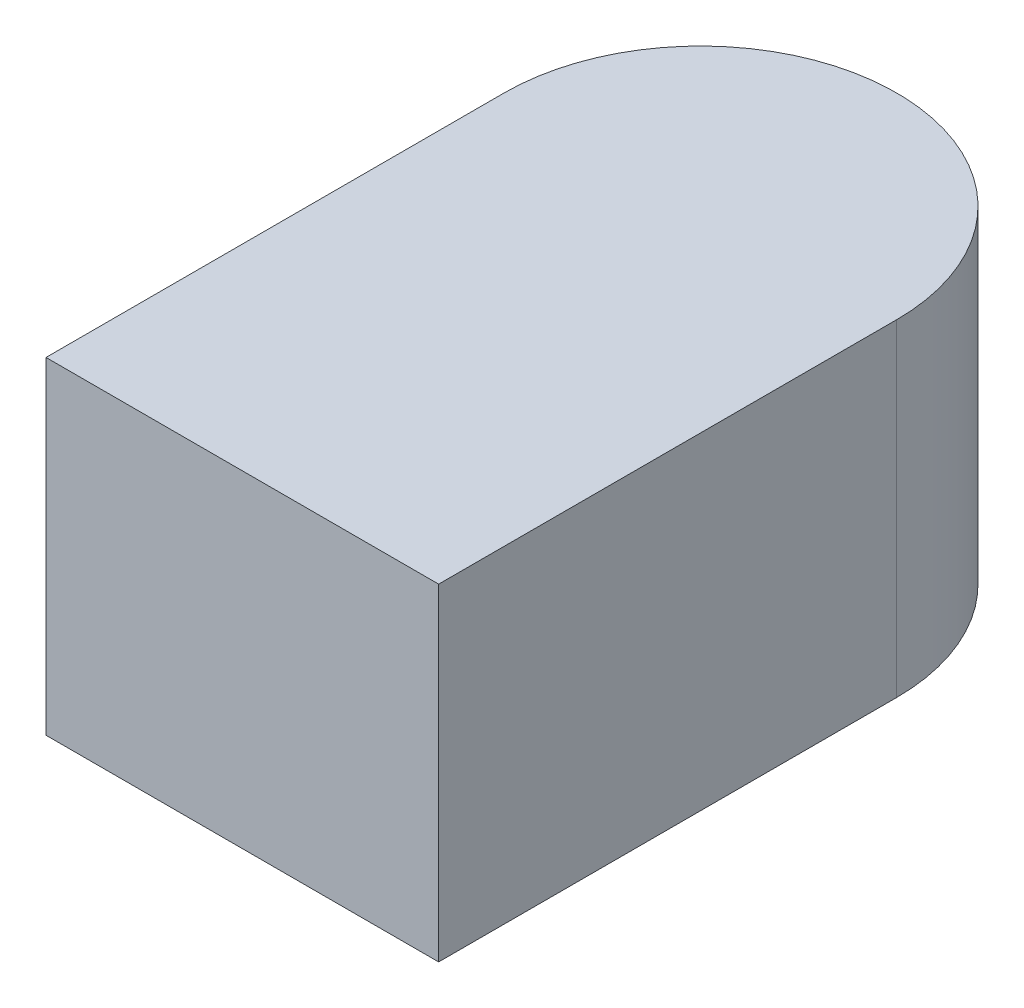
ISO-10303-21;
HEADER;
FILE_DESCRIPTION(('STEP AP214'),'2;1');
FILE_NAME('part.step','',(''),(''),'','','');
FILE_SCHEMA(('AUTOMOTIVE_DESIGN { 1 0 10303 214 1 1 1 1 }'));
ENDSEC;
DATA;
#1=APPLICATION_CONTEXT('core data for automotive mechanical design processes');
#2=APPLICATION_PROTOCOL_DEFINITION('international standard','automotive_design',2000,#1);
#3=PRODUCT_CONTEXT('',#1,'mechanical');
#4=PRODUCT('Part','Part','',(#3));
#5=PRODUCT_RELATED_PRODUCT_CATEGORY('part','',(#4));
#6=PRODUCT_DEFINITION_FORMATION('','',#4);
#7=PRODUCT_DEFINITION_CONTEXT('part definition',#1,'design');
#8=PRODUCT_DEFINITION('design','',#6,#7);
#9=PRODUCT_DEFINITION_SHAPE('','',#8);
#10=(LENGTH_UNIT() NAMED_UNIT(*) SI_UNIT(.MILLI.,.METRE.));
#11=(NAMED_UNIT(*) PLANE_ANGLE_UNIT() SI_UNIT($,.RADIAN.));
#12=(NAMED_UNIT(*) SI_UNIT($,.STERADIAN.) SOLID_ANGLE_UNIT());
#13=UNCERTAINTY_MEASURE_WITH_UNIT(LENGTH_MEASURE(1.E-05),#10,'distance_accuracy_value','');
#14=(GEOMETRIC_REPRESENTATION_CONTEXT(3) GLOBAL_UNCERTAINTY_ASSIGNED_CONTEXT((#13)) GLOBAL_UNIT_ASSIGNED_CONTEXT((#10,
#11,#12)) REPRESENTATION_CONTEXT('',''));
#15=CARTESIAN_POINT('',(0.,0.,0.));
#16=DIRECTION('',(0.,0.,1.));
#17=DIRECTION('',(1.,0.,0.));
#18=AXIS2_PLACEMENT_3D('',#15,#16,#17);
#19=CARTESIAN_POINT('',(0.,0.,0.));
#20=DIRECTION('',(0.,-1.,0.));
#21=DIRECTION('',(1.,0.,0.));
#22=AXIS2_PLACEMENT_3D('',#19,#20,#21);
#23=PLANE('',#22);
#24=CARTESIAN_POINT('',(-0.75,0.,1.97));
#25=DIRECTION('',(0.,-1.,0.));
#26=DIRECTION('',(-1.,0.,0.));
#27=AXIS2_PLACEMENT_3D('',#24,#25,#26);
#28=CIRCLE('',#27,0.12);
#29=CARTESIAN_POINT('',(-0.87,0.,1.97));
#30=VERTEX_POINT('',#29);
#31=CARTESIAN_POINT('',(-0.63,0.,1.97));
#32=VERTEX_POINT('',#31);
#33=EDGE_CURVE('E11',#30,#32,#28,.T.);
#34=ORIENTED_EDGE('',*,*,#33,.T.);
#35=DIRECTION('',(0.,0.,1.));
#36=VECTOR('',#35,1.);
#37=CARTESIAN_POINT('',(-0.63,0.,1.97));
#38=LINE('',#37,#36);
#39=CARTESIAN_POINT('',(-0.63,0.,2.25));
#40=VERTEX_POINT('',#39);
#41=EDGE_CURVE('E24',#32,#40,#38,.T.);
#42=ORIENTED_EDGE('',*,*,#41,.T.);
#43=DIRECTION('',(-1.,0.,0.));
#44=VECTOR('',#43,1.);
#45=CARTESIAN_POINT('',(-0.63,0.,2.25));
#46=LINE('',#45,#44);
#47=CARTESIAN_POINT('',(-0.87,0.,2.25));
#48=VERTEX_POINT('',#47);
#49=EDGE_CURVE('E62',#40,#48,#46,.T.);
#50=ORIENTED_EDGE('',*,*,#49,.T.);
#51=DIRECTION('',(0.,0.,-1.));
#52=VECTOR('',#51,1.);
#53=CARTESIAN_POINT('',(-0.87,0.,2.25));
#54=LINE('',#53,#52);
#55=EDGE_CURVE('E36',#48,#30,#54,.T.);
#56=ORIENTED_EDGE('',*,*,#55,.T.);
#57=EDGE_LOOP('',(#34,#42,#50,#56));
#58=FACE_BOUND('',#57,.T.);
#59=ADVANCED_FACE('F17',(#58),#23,.T.);
#60=CARTESIAN_POINT('',(-0.87,0.,2.25));
#61=DIRECTION('',(1.,0.,0.));
#62=DIRECTION('',(0.,0.,-1.));
#63=AXIS2_PLACEMENT_3D('',#60,#61,#62);
#64=PLANE('',#63);
#65=DIRECTION('',(0.,1.,0.));
#66=VECTOR('',#65,1.);
#67=CARTESIAN_POINT('',(-0.87,0.,2.25));
#68=LINE('',#67,#66);
#69=CARTESIAN_POINT('',(-0.87,0.2,2.25));
#70=VERTEX_POINT('',#69);
#71=EDGE_CURVE('E84',#48,#70,#68,.T.);
#72=ORIENTED_EDGE('',*,*,#71,.T.);
#73=DIRECTION('',(0.,0.,-1.));
#74=VECTOR('',#73,1.);
#75=CARTESIAN_POINT('',(-0.87,0.2,2.25));
#76=LINE('',#75,#74);
#77=CARTESIAN_POINT('',(-0.87,0.2,1.97));
#78=VERTEX_POINT('',#77);
#79=EDGE_CURVE('E74',#70,#78,#76,.T.);
#80=ORIENTED_EDGE('',*,*,#79,.T.);
#81=DIRECTION('',(0.,1.,0.));
#82=VECTOR('',#81,1.);
#83=CARTESIAN_POINT('',(-0.87,0.,1.97));
#84=LINE('',#83,#82);
#85=EDGE_CURVE('E81',#30,#78,#84,.T.);
#86=ORIENTED_EDGE('',*,*,#85,.F.);
#87=ORIENTED_EDGE('',*,*,#55,.F.);
#88=EDGE_LOOP('',(#72,#80,#86,#87));
#89=FACE_BOUND('',#88,.T.);
#90=ADVANCED_FACE('F91',(#89),#64,.F.);
#91=CARTESIAN_POINT('',(-0.75,0.,1.97));
#92=DIRECTION('',(0.,-1.,0.));
#93=DIRECTION('',(1.,0.,0.));
#94=AXIS2_PLACEMENT_3D('',#91,#92,#93);
#95=CYLINDRICAL_SURFACE('',#94,0.12);
#96=ORIENTED_EDGE('',*,*,#85,.T.);
#97=CARTESIAN_POINT('',(-0.75,0.2,1.97));
#98=DIRECTION('',(0.,-1.,0.));
#99=DIRECTION('',(-1.,0.,0.));
#100=AXIS2_PLACEMENT_3D('',#97,#98,#99);
#101=CIRCLE('',#100,0.12);
#102=CARTESIAN_POINT('',(-0.63,0.2,1.97));
#103=VERTEX_POINT('',#102);
#104=EDGE_CURVE('E79',#78,#103,#101,.T.);
#105=ORIENTED_EDGE('',*,*,#104,.T.);
#106=DIRECTION('',(0.,1.,0.));
#107=VECTOR('',#106,1.);
#108=CARTESIAN_POINT('',(-0.63,0.,1.97));
#109=LINE('',#108,#107);
#110=EDGE_CURVE('E68',#32,#103,#109,.T.);
#111=ORIENTED_EDGE('',*,*,#110,.F.);
#112=ORIENTED_EDGE('',*,*,#33,.F.);
#113=EDGE_LOOP('',(#96,#105,#111,#112));
#114=FACE_BOUND('',#113,.T.);
#115=ADVANCED_FACE('F89',(#114),#95,.T.);
#116=CARTESIAN_POINT('',(-0.63,0.,1.97));
#117=DIRECTION('',(-1.,0.,0.));
#118=DIRECTION('',(0.,0.,1.));
#119=AXIS2_PLACEMENT_3D('',#116,#117,#118);
#120=PLANE('',#119);
#121=ORIENTED_EDGE('',*,*,#110,.T.);
#122=DIRECTION('',(0.,0.,1.));
#123=VECTOR('',#122,1.);
#124=CARTESIAN_POINT('',(-0.63,0.2,1.97));
#125=LINE('',#124,#123);
#126=CARTESIAN_POINT('',(-0.63,0.2,2.25));
#127=VERTEX_POINT('',#126);
#128=EDGE_CURVE('E63',#103,#127,#125,.T.);
#129=ORIENTED_EDGE('',*,*,#128,.T.);
#130=DIRECTION('',(0.,1.,0.));
#131=VECTOR('',#130,1.);
#132=CARTESIAN_POINT('',(-0.63,0.,2.25));
#133=LINE('',#132,#131);
#134=EDGE_CURVE('E56',#40,#127,#133,.T.);
#135=ORIENTED_EDGE('',*,*,#134,.F.);
#136=ORIENTED_EDGE('',*,*,#41,.F.);
#137=EDGE_LOOP('',(#121,#129,#135,#136));
#138=FACE_BOUND('',#137,.T.);
#139=ADVANCED_FACE('F66',(#138),#120,.F.);
#140=CARTESIAN_POINT('',(-0.63,0.,2.25));
#141=DIRECTION('',(0.,0.,-1.));
#142=DIRECTION('',(-1.,0.,0.));
#143=AXIS2_PLACEMENT_3D('',#140,#141,#142);
#144=PLANE('',#143);
#145=ORIENTED_EDGE('',*,*,#134,.T.);
#146=DIRECTION('',(-1.,0.,0.));
#147=VECTOR('',#146,1.);
#148=CARTESIAN_POINT('',(-0.63,0.2,2.25));
#149=LINE('',#148,#147);
#150=EDGE_CURVE('E61',#127,#70,#149,.T.);
#151=ORIENTED_EDGE('',*,*,#150,.T.);
#152=ORIENTED_EDGE('',*,*,#71,.F.);
#153=ORIENTED_EDGE('',*,*,#49,.F.);
#154=EDGE_LOOP('',(#145,#151,#152,#153));
#155=FACE_BOUND('',#154,.T.);
#156=ADVANCED_FACE('F58',(#155),#144,.F.);
#157=CARTESIAN_POINT('',(0.,0.2,0.));
#158=DIRECTION('',(0.,-1.,0.));
#159=DIRECTION('',(1.,0.,0.));
#160=AXIS2_PLACEMENT_3D('',#157,#158,#159);
#161=PLANE('',#160);
#162=ORIENTED_EDGE('',*,*,#150,.F.);
#163=ORIENTED_EDGE('',*,*,#128,.F.);
#164=ORIENTED_EDGE('',*,*,#104,.F.);
#165=ORIENTED_EDGE('',*,*,#79,.F.);
#166=EDGE_LOOP('',(#162,#163,#164,#165));
#167=FACE_BOUND('',#166,.T.);
#168=ADVANCED_FACE('F72',(#167),#161,.F.);
#169=CLOSED_SHELL('',(#59,#90,#115,#139,#156,#168));
#170=MANIFOLD_SOLID_BREP('B1',#169);
#171=ADVANCED_BREP_SHAPE_REPRESENTATION('',(#18,#170),#14);
#172=SHAPE_DEFINITION_REPRESENTATION(#9,#171);
ENDSEC;
END-ISO-10303-21;
